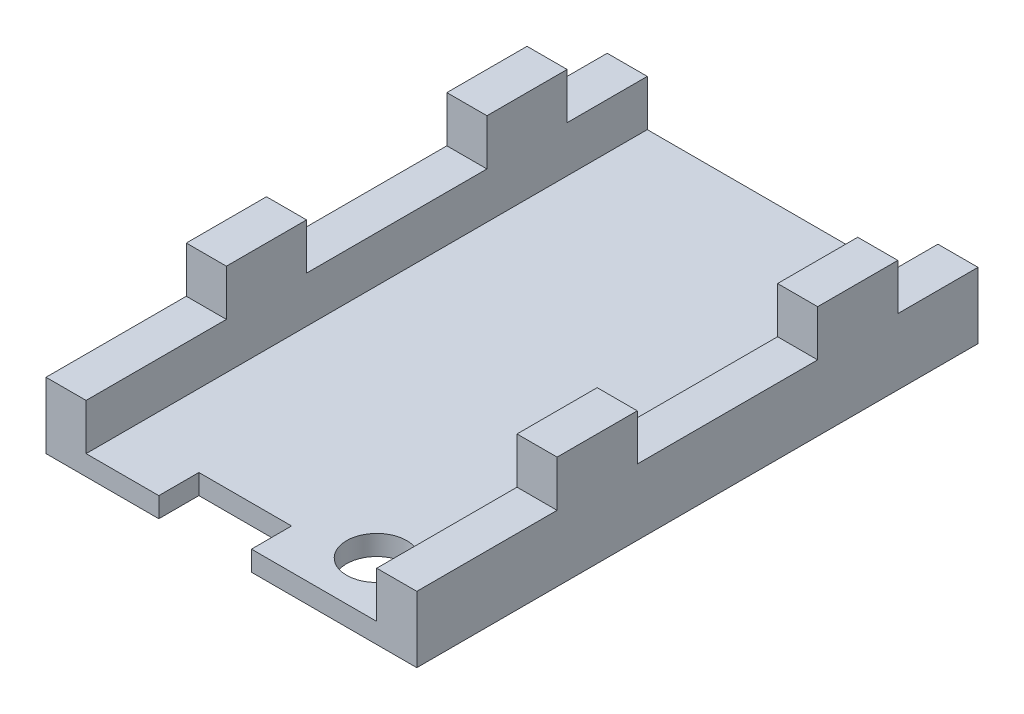
ISO-10303-21;
HEADER;
FILE_DESCRIPTION(('STEP AP214'),'2;1');
FILE_NAME('part.step','',(''),(''),'','','');
FILE_SCHEMA(('AUTOMOTIVE_DESIGN { 1 0 10303 214 1 1 1 1 }'));
ENDSEC;
DATA;
#1=APPLICATION_CONTEXT('core data for automotive mechanical design processes');
#2=APPLICATION_PROTOCOL_DEFINITION('international standard','automotive_design',2000,#1);
#3=PRODUCT_CONTEXT('',#1,'mechanical');
#4=PRODUCT('Part','Part','',(#3));
#5=PRODUCT_RELATED_PRODUCT_CATEGORY('part','',(#4));
#6=PRODUCT_DEFINITION_FORMATION('','',#4);
#7=PRODUCT_DEFINITION_CONTEXT('part definition',#1,'design');
#8=PRODUCT_DEFINITION('design','',#6,#7);
#9=PRODUCT_DEFINITION_SHAPE('','',#8);
#10=(LENGTH_UNIT() NAMED_UNIT(*) SI_UNIT(.MILLI.,.METRE.));
#11=(NAMED_UNIT(*) PLANE_ANGLE_UNIT() SI_UNIT($,.RADIAN.));
#12=(NAMED_UNIT(*) SI_UNIT($,.STERADIAN.) SOLID_ANGLE_UNIT());
#13=UNCERTAINTY_MEASURE_WITH_UNIT(LENGTH_MEASURE(1.E-05),#10,'distance_accuracy_value','');
#14=(GEOMETRIC_REPRESENTATION_CONTEXT(3) GLOBAL_UNCERTAINTY_ASSIGNED_CONTEXT((#13)) GLOBAL_UNIT_ASSIGNED_CONTEXT((#10,
#11,#12)) REPRESENTATION_CONTEXT('',''));
#15=CARTESIAN_POINT('',(0.,0.,0.));
#16=DIRECTION('',(0.,0.,1.));
#17=DIRECTION('',(1.,0.,0.));
#18=AXIS2_PLACEMENT_3D('',#15,#16,#17);
#19=CARTESIAN_POINT('',(0.,3.3,0.));
#20=DIRECTION('',(0.,-1.,0.));
#21=DIRECTION('',(0.,0.,-1.));
#22=AXIS2_PLACEMENT_3D('',#19,#20,#21);
#23=PLANE('',#22);
#24=DIRECTION('',(1.,0.,0.));
#25=VECTOR('',#24,1.);
#26=CARTESIAN_POINT('',(-12.7473745827803,3.3,6.34895788650398));
#27=LINE('',#26,#25);
#28=CARTESIAN_POINT('',(-12.7473745827803,3.3,6.34895788650398));
#29=VERTEX_POINT('',#28);
#30=CARTESIAN_POINT('',(-10.7473745827803,3.3,6.34895788650398));
#31=VERTEX_POINT('',#30);
#32=EDGE_CURVE('E516',#29,#31,#27,.T.);
#33=ORIENTED_EDGE('',*,*,#32,.F.);
#34=DIRECTION('',(0.,0.,1.));
#35=VECTOR('',#34,1.);
#36=CARTESIAN_POINT('',(-12.7473745827803,3.3,-14.651042113496));
#37=LINE('',#36,#35);
#38=CARTESIAN_POINT('',(-12.7473745827803,3.3,13.348957886504));
#39=VERTEX_POINT('',#38);
#40=EDGE_CURVE('E245',#29,#39,#37,.T.);
#41=ORIENTED_EDGE('',*,*,#40,.T.);
#42=DIRECTION('',(1.,0.,0.));
#43=VECTOR('',#42,1.);
#44=CARTESIAN_POINT('',(-10.7473745827803,3.3,13.348957886504));
#45=LINE('',#44,#43);
#46=CARTESIAN_POINT('',(-10.7473745827803,3.3,13.348957886504));
#47=VERTEX_POINT('',#46);
#48=EDGE_CURVE('E369',#39,#47,#45,.T.);
#49=ORIENTED_EDGE('',*,*,#48,.T.);
#50=DIRECTION('',(0.,0.,-1.));
#51=VECTOR('',#50,1.);
#52=CARTESIAN_POINT('',(-10.7473745827803,3.3,-14.651042113496));
#53=LINE('',#52,#51);
#54=EDGE_CURVE('E59',#47,#31,#53,.T.);
#55=ORIENTED_EDGE('',*,*,#54,.T.);
#56=EDGE_LOOP('',(#33,#41,#49,#55));
#57=FACE_BOUND('',#56,.T.);
#58=ADVANCED_FACE('F33',(#57),#23,.F.);
#59=DIRECTION('',(-1.,0.,0.));
#60=VECTOR('',#59,1.);
#61=CARTESIAN_POINT('',(-12.7473745827803,3.3,2.34895788650399));
#62=LINE('',#61,#60);
#63=CARTESIAN_POINT('',(-10.7473745827803,3.3,2.34895788650399));
#64=VERTEX_POINT('',#63);
#65=CARTESIAN_POINT('',(-12.7473745827803,3.3,2.34895788650399));
#66=VERTEX_POINT('',#65);
#67=EDGE_CURVE('E51',#64,#66,#62,.T.);
#68=ORIENTED_EDGE('',*,*,#67,.F.);
#69=CARTESIAN_POINT('',(-10.7473745827803,3.3,-6.65104211349602));
#70=VERTEX_POINT('',#69);
#71=EDGE_CURVE('E364',#64,#70,#53,.T.);
#72=ORIENTED_EDGE('',*,*,#71,.T.);
#73=DIRECTION('',(1.,0.,0.));
#74=VECTOR('',#73,1.);
#75=CARTESIAN_POINT('',(-12.7473745827803,3.3,-6.65104211349602));
#76=LINE('',#75,#74);
#77=CARTESIAN_POINT('',(-12.7473745827803,3.3,-6.65104211349602));
#78=VERTEX_POINT('',#77);
#79=EDGE_CURVE('E246',#78,#70,#76,.T.);
#80=ORIENTED_EDGE('',*,*,#79,.F.);
#81=EDGE_CURVE('E370',#78,#66,#37,.T.);
#82=ORIENTED_EDGE('',*,*,#81,.T.);
#83=EDGE_LOOP('',(#68,#72,#80,#82));
#84=FACE_BOUND('',#83,.T.);
#85=ADVANCED_FACE('F537',(#84),#23,.F.);
#86=DIRECTION('',(-1.,0.,0.));
#87=VECTOR('',#86,1.);
#88=CARTESIAN_POINT('',(-12.7473745827803,3.3,-10.651042113496));
#89=LINE('',#88,#87);
#90=CARTESIAN_POINT('',(-10.7473745827803,3.3,-10.651042113496));
#91=VERTEX_POINT('',#90);
#92=CARTESIAN_POINT('',(-12.7473745827803,3.3,-10.651042113496));
#93=VERTEX_POINT('',#92);
#94=EDGE_CURVE('E249',#91,#93,#89,.T.);
#95=ORIENTED_EDGE('',*,*,#94,.F.);
#96=CARTESIAN_POINT('',(-10.7473745827803,3.3,-14.651042113496));
#97=VERTEX_POINT('',#96);
#98=EDGE_CURVE('E365',#91,#97,#53,.T.);
#99=ORIENTED_EDGE('',*,*,#98,.T.);
#100=DIRECTION('',(-1.,0.,0.));
#101=VECTOR('',#100,1.);
#102=CARTESIAN_POINT('',(-10.7473745827803,3.3,-14.651042113496));
#103=LINE('',#102,#101);
#104=CARTESIAN_POINT('',(-12.7473745827803,3.3,-14.651042113496));
#105=VERTEX_POINT('',#104);
#106=EDGE_CURVE('E363',#97,#105,#103,.T.);
#107=ORIENTED_EDGE('',*,*,#106,.T.);
#108=EDGE_CURVE('E367',#105,#93,#37,.T.);
#109=ORIENTED_EDGE('',*,*,#108,.T.);
#110=EDGE_LOOP('',(#95,#99,#107,#109));
#111=FACE_BOUND('',#110,.T.);
#112=ADVANCED_FACE('F536',(#111),#23,.F.);
#113=CARTESIAN_POINT('',(0.,3.3,0.));
#114=DIRECTION('',(0.,1.,0.));
#115=DIRECTION('',(0.,0.,1.));
#116=AXIS2_PLACEMENT_3D('',#113,#114,#115);
#117=PLANE('',#116);
#118=DIRECTION('',(0.,0.,-1.));
#119=VECTOR('',#118,1.);
#120=CARTESIAN_POINT('',(-27.2473745827803,3.3,-14.651042113496));
#121=LINE('',#120,#119);
#122=CARTESIAN_POINT('',(-27.2473745827803,3.3,13.348957886504));
#123=VERTEX_POINT('',#122);
#124=CARTESIAN_POINT('',(-27.2473745827803,3.3,6.34895788650398));
#125=VERTEX_POINT('',#124);
#126=EDGE_CURVE('E387',#123,#125,#121,.T.);
#127=ORIENTED_EDGE('',*,*,#126,.T.);
#128=DIRECTION('',(1.,0.,0.));
#129=VECTOR('',#128,1.);
#130=CARTESIAN_POINT('',(-29.2473745827803,3.3,6.34895788650398));
#131=LINE('',#130,#129);
#132=CARTESIAN_POINT('',(-29.2473745827803,3.3,6.34895788650398));
#133=VERTEX_POINT('',#132);
#134=EDGE_CURVE('E278',#133,#125,#131,.T.);
#135=ORIENTED_EDGE('',*,*,#134,.F.);
#136=DIRECTION('',(0.,0.,1.));
#137=VECTOR('',#136,1.);
#138=CARTESIAN_POINT('',(-29.2473745827803,3.3,-14.651042113496));
#139=LINE('',#138,#137);
#140=CARTESIAN_POINT('',(-29.2473745827803,3.3,13.348957886504));
#141=VERTEX_POINT('',#140);
#142=EDGE_CURVE('E384',#133,#141,#139,.T.);
#143=ORIENTED_EDGE('',*,*,#142,.T.);
#144=DIRECTION('',(1.,0.,0.));
#145=VECTOR('',#144,1.);
#146=CARTESIAN_POINT('',(-29.2473745827803,3.3,13.348957886504));
#147=LINE('',#146,#145);
#148=EDGE_CURVE('E382',#141,#123,#147,.T.);
#149=ORIENTED_EDGE('',*,*,#148,.T.);
#150=EDGE_LOOP('',(#127,#135,#143,#149));
#151=FACE_BOUND('',#150,.T.);
#152=ADVANCED_FACE('F502',(#151),#117,.T.);
#153=CARTESIAN_POINT('',(-29.2473745827803,3.3,-6.65104211349602));
#154=VERTEX_POINT('',#153);
#155=CARTESIAN_POINT('',(-29.2473745827803,3.3,2.34895788650399));
#156=VERTEX_POINT('',#155);
#157=EDGE_CURVE('E383',#154,#156,#139,.T.);
#158=ORIENTED_EDGE('',*,*,#157,.T.);
#159=DIRECTION('',(-1.,0.,0.));
#160=VECTOR('',#159,1.);
#161=CARTESIAN_POINT('',(-29.2473745827803,3.3,2.34895788650398));
#162=LINE('',#161,#160);
#163=CARTESIAN_POINT('',(-27.2473745827803,3.3,2.34895788650398));
#164=VERTEX_POINT('',#163);
#165=EDGE_CURVE('E283',#164,#156,#162,.T.);
#166=ORIENTED_EDGE('',*,*,#165,.F.);
#167=CARTESIAN_POINT('',(-27.2473745827803,3.3,-6.65104211349602));
#168=VERTEX_POINT('',#167);
#169=EDGE_CURVE('E390',#164,#168,#121,.T.);
#170=ORIENTED_EDGE('',*,*,#169,.T.);
#171=DIRECTION('',(1.,0.,0.));
#172=VECTOR('',#171,1.);
#173=CARTESIAN_POINT('',(-29.2473745827803,3.3,-6.65104211349602));
#174=LINE('',#173,#172);
#175=EDGE_CURVE('E305',#154,#168,#174,.T.);
#176=ORIENTED_EDGE('',*,*,#175,.F.);
#177=EDGE_LOOP('',(#158,#166,#170,#176));
#178=FACE_BOUND('',#177,.T.);
#179=ADVANCED_FACE('F489',(#178),#117,.T.);
#180=CARTESIAN_POINT('',(-29.2473745827803,3.3,-14.651042113496));
#181=VERTEX_POINT('',#180);
#182=CARTESIAN_POINT('',(-29.2473745827803,3.3,-10.651042113496));
#183=VERTEX_POINT('',#182);
#184=EDGE_CURVE('E379',#181,#183,#139,.T.);
#185=ORIENTED_EDGE('',*,*,#184,.T.);
#186=DIRECTION('',(-1.,0.,0.));
#187=VECTOR('',#186,1.);
#188=CARTESIAN_POINT('',(-29.2473745827803,3.3,-10.651042113496));
#189=LINE('',#188,#187);
#190=CARTESIAN_POINT('',(-27.2473745827803,3.3,-10.651042113496));
#191=VERTEX_POINT('',#190);
#192=EDGE_CURVE('E310',#191,#183,#189,.T.);
#193=ORIENTED_EDGE('',*,*,#192,.F.);
#194=CARTESIAN_POINT('',(-27.2473745827803,3.3,-14.651042113496));
#195=VERTEX_POINT('',#194);
#196=EDGE_CURVE('E386',#191,#195,#121,.T.);
#197=ORIENTED_EDGE('',*,*,#196,.T.);
#198=DIRECTION('',(-1.,0.,0.));
#199=VECTOR('',#198,1.);
#200=CARTESIAN_POINT('',(-29.2473745827803,3.3,-14.651042113496));
#201=LINE('',#200,#199);
#202=EDGE_CURVE('E389',#195,#181,#201,.T.);
#203=ORIENTED_EDGE('',*,*,#202,.T.);
#204=EDGE_LOOP('',(#185,#193,#197,#203));
#205=FACE_BOUND('',#204,.T.);
#206=ADVANCED_FACE('F474',(#205),#117,.T.);
#207=CARTESIAN_POINT('',(-29.2473745827803,1.,13.348957886504));
#208=DIRECTION('',(0.,0.,-1.));
#209=DIRECTION('',(-1.,0.,0.));
#210=AXIS2_PLACEMENT_3D('',#207,#208,#209);
#211=PLANE('',#210);
#212=DIRECTION('',(1.,0.,0.));
#213=VECTOR('',#212,1.);
#214=CARTESIAN_POINT('',(-29.2473745827803,1.,13.348957886504));
#215=LINE('',#214,#213);
#216=CARTESIAN_POINT('',(-18.9957745827803,1.,13.348957886504));
#217=VERTEX_POINT('',#216);
#218=CARTESIAN_POINT('',(-12.7473745827803,1.,13.348957886504));
#219=VERTEX_POINT('',#218);
#220=EDGE_CURVE('E37',#217,#219,#215,.T.);
#221=ORIENTED_EDGE('',*,*,#220,.F.);
#222=DIRECTION('',(0.,-1.,0.));
#223=VECTOR('',#222,1.);
#224=CARTESIAN_POINT('',(-18.9957745827803,2.3,13.348957886504));
#225=LINE('',#224,#223);
#226=CARTESIAN_POINT('',(-18.9957745827803,0.,13.348957886504));
#227=VERTEX_POINT('',#226);
#228=EDGE_CURVE('E337',#217,#227,#225,.T.);
#229=ORIENTED_EDGE('',*,*,#228,.T.);
#230=DIRECTION('',(1.,0.,0.));
#231=VECTOR('',#230,1.);
#232=CARTESIAN_POINT('',(-29.2473745827803,0.,13.348957886504));
#233=LINE('',#232,#231);
#234=CARTESIAN_POINT('',(-10.7473745827803,0.,13.348957886504));
#235=VERTEX_POINT('',#234);
#236=EDGE_CURVE('E421',#227,#235,#233,.T.);
#237=ORIENTED_EDGE('',*,*,#236,.T.);
#238=DIRECTION('',(0.,-1.,0.));
#239=VECTOR('',#238,1.);
#240=CARTESIAN_POINT('',(-10.7473745827803,1.,13.348957886504));
#241=LINE('',#240,#239);
#242=EDGE_CURVE('E433',#47,#235,#241,.T.);
#243=ORIENTED_EDGE('',*,*,#242,.F.);
#244=ORIENTED_EDGE('',*,*,#48,.F.);
#245=DIRECTION('',(0.,-1.,0.));
#246=VECTOR('',#245,1.);
#247=CARTESIAN_POINT('',(-12.7473745827803,3.3,13.348957886504));
#248=LINE('',#247,#246);
#249=EDGE_CURVE('E372',#39,#219,#248,.T.);
#250=ORIENTED_EDGE('',*,*,#249,.T.);
#251=EDGE_LOOP('',(#221,#229,#237,#243,#244,#250));
#252=FACE_BOUND('',#251,.T.);
#253=ADVANCED_FACE('F465',(#252),#211,.F.);
#254=CARTESIAN_POINT('',(0.,1.,0.));
#255=DIRECTION('',(0.,-1.,0.));
#256=DIRECTION('',(0.,0.,-1.));
#257=AXIS2_PLACEMENT_3D('',#254,#255,#256);
#258=PLANE('',#257);
#259=CARTESIAN_POINT('',(-15.4905745827803,1.,10.605757886504));
#260=DIRECTION('',(0.,-1.,0.));
#261=DIRECTION('',(0.,0.,-1.));
#262=AXIS2_PLACEMENT_3D('',#259,#260,#261);
#263=CIRCLE('',#262,1.5);
#264=CARTESIAN_POINT('',(-15.4905745827803,1.,9.10575788650398));
#265=VERTEX_POINT('',#264);
#266=EDGE_CURVE('E358',#265,#265,#263,.T.);
#267=ORIENTED_EDGE('',*,*,#266,.T.);
#268=EDGE_LOOP('',(#267));
#269=FACE_BOUND('',#268,.T.);
#270=DIRECTION('',(1.,0.,0.));
#271=VECTOR('',#270,1.);
#272=CARTESIAN_POINT('',(0.,1.,11.348957886504));
#273=LINE('',#272,#271);
#274=CARTESIAN_POINT('',(-23.6185745827803,1.,11.348957886504));
#275=VERTEX_POINT('',#274);
#276=CARTESIAN_POINT('',(-18.9957745827803,1.,11.348957886504));
#277=VERTEX_POINT('',#276);
#278=EDGE_CURVE('E349',#275,#277,#273,.T.);
#279=ORIENTED_EDGE('',*,*,#278,.T.);
#280=DIRECTION('',(0.,0.,1.));
#281=VECTOR('',#280,1.);
#282=CARTESIAN_POINT('',(-18.9957745827803,1.,0.));
#283=LINE('',#282,#281);
#284=EDGE_CURVE('E352',#277,#217,#283,.T.);
#285=ORIENTED_EDGE('',*,*,#284,.T.);
#286=ORIENTED_EDGE('',*,*,#220,.T.);
#287=DIRECTION('',(0.,0.,1.));
#288=VECTOR('',#287,1.);
#289=CARTESIAN_POINT('',(-12.7473745827803,1.,-14.651042113496));
#290=LINE('',#289,#288);
#291=CARTESIAN_POINT('',(-12.7473745827803,1.,-14.651042113496));
#292=VERTEX_POINT('',#291);
#293=EDGE_CURVE('E361',#292,#219,#290,.T.);
#294=ORIENTED_EDGE('',*,*,#293,.F.);
#295=DIRECTION('',(1.,0.,0.));
#296=VECTOR('',#295,1.);
#297=CARTESIAN_POINT('',(-29.2473745827803,1.,-14.651042113496));
#298=LINE('',#297,#296);
#299=CARTESIAN_POINT('',(-27.2473745827803,1.,-14.651042113496));
#300=VERTEX_POINT('',#299);
#301=EDGE_CURVE('E429',#300,#292,#298,.T.);
#302=ORIENTED_EDGE('',*,*,#301,.F.);
#303=DIRECTION('',(0.,0.,-1.));
#304=VECTOR('',#303,1.);
#305=CARTESIAN_POINT('',(-27.2473745827803,1.,-14.651042113496));
#306=LINE('',#305,#304);
#307=CARTESIAN_POINT('',(-27.2473745827803,1.,13.348957886504));
#308=VERTEX_POINT('',#307);
#309=EDGE_CURVE('E378',#308,#300,#306,.T.);
#310=ORIENTED_EDGE('',*,*,#309,.F.);
#311=CARTESIAN_POINT('',(-23.6185745827803,1.,13.348957886504));
#312=VERTEX_POINT('',#311);
#313=EDGE_CURVE('E401',#308,#312,#215,.T.);
#314=ORIENTED_EDGE('',*,*,#313,.T.);
#315=DIRECTION('',(0.,0.,-1.));
#316=VECTOR('',#315,1.);
#317=CARTESIAN_POINT('',(-23.6185745827803,1.,0.));
#318=LINE('',#317,#316);
#319=EDGE_CURVE('E340',#312,#275,#318,.T.);
#320=ORIENTED_EDGE('',*,*,#319,.T.);
#321=EDGE_LOOP('',(#279,#285,#286,#294,#302,#310,#314,#320));
#322=FACE_BOUND('',#321,.T.);
#323=ADVANCED_FACE('F445',(#269,#322),#258,.F.);
#324=CARTESIAN_POINT('',(-29.2473745827803,1.,-14.651042113496));
#325=DIRECTION('',(0.,0.,-1.));
#326=DIRECTION('',(-1.,0.,0.));
#327=AXIS2_PLACEMENT_3D('',#324,#325,#326);
#328=PLANE('',#327);
#329=DIRECTION('',(1.,0.,0.));
#330=VECTOR('',#329,1.);
#331=CARTESIAN_POINT('',(-29.2473745827803,0.,-14.651042113496));
#332=LINE('',#331,#330);
#333=CARTESIAN_POINT('',(-29.2473745827803,0.,-14.651042113496));
#334=VERTEX_POINT('',#333);
#335=CARTESIAN_POINT('',(-10.7473745827803,0.,-14.651042113496));
#336=VERTEX_POINT('',#335);
#337=EDGE_CURVE('E409',#334,#336,#332,.T.);
#338=ORIENTED_EDGE('',*,*,#337,.F.);
#339=DIRECTION('',(0.,-1.,0.));
#340=VECTOR('',#339,1.);
#341=CARTESIAN_POINT('',(-29.2473745827803,1.,-14.651042113496));
#342=LINE('',#341,#340);
#343=EDGE_CURVE('E11',#181,#334,#342,.T.);
#344=ORIENTED_EDGE('',*,*,#343,.F.);
#345=ORIENTED_EDGE('',*,*,#202,.F.);
#346=DIRECTION('',(0.,-1.,0.));
#347=VECTOR('',#346,1.);
#348=CARTESIAN_POINT('',(-27.2473745827803,3.3,-14.651042113496));
#349=LINE('',#348,#347);
#350=EDGE_CURVE('E393',#195,#300,#349,.T.);
#351=ORIENTED_EDGE('',*,*,#350,.T.);
#352=ORIENTED_EDGE('',*,*,#301,.T.);
#353=DIRECTION('',(0.,-1.,0.));
#354=VECTOR('',#353,1.);
#355=CARTESIAN_POINT('',(-12.7473745827803,3.3,-14.651042113496));
#356=LINE('',#355,#354);
#357=EDGE_CURVE('E376',#105,#292,#356,.T.);
#358=ORIENTED_EDGE('',*,*,#357,.F.);
#359=ORIENTED_EDGE('',*,*,#106,.F.);
#360=DIRECTION('',(0.,-1.,0.));
#361=VECTOR('',#360,1.);
#362=CARTESIAN_POINT('',(-10.7473745827803,1.,-14.651042113496));
#363=LINE('',#362,#361);
#364=EDGE_CURVE('E436',#97,#336,#363,.T.);
#365=ORIENTED_EDGE('',*,*,#364,.T.);
#366=EDGE_LOOP('',(#338,#344,#345,#351,#352,#358,#359,#365));
#367=FACE_BOUND('',#366,.T.);
#368=ADVANCED_FACE('F35',(#367),#328,.T.);
#369=CARTESIAN_POINT('',(-29.2473745827803,1.,-14.651042113496));
#370=DIRECTION('',(1.,0.,0.));
#371=DIRECTION('',(0.,0.,-1.));
#372=AXIS2_PLACEMENT_3D('',#369,#370,#371);
#373=PLANE('',#372);
#374=DIRECTION('',(0.,0.,1.));
#375=VECTOR('',#374,1.);
#376=CARTESIAN_POINT('',(-29.2473745827803,0.,-14.651042113496));
#377=LINE('',#376,#375);
#378=CARTESIAN_POINT('',(-29.2473745827803,0.,13.348957886504));
#379=VERTEX_POINT('',#378);
#380=EDGE_CURVE('E428',#334,#379,#377,.T.);
#381=ORIENTED_EDGE('',*,*,#380,.T.);
#382=DIRECTION('',(0.,-1.,0.));
#383=VECTOR('',#382,1.);
#384=CARTESIAN_POINT('',(-29.2473745827803,1.,13.348957886504));
#385=LINE('',#384,#383);
#386=EDGE_CURVE('E43',#141,#379,#385,.T.);
#387=ORIENTED_EDGE('',*,*,#386,.F.);
#388=ORIENTED_EDGE('',*,*,#142,.F.);
#389=DIRECTION('',(0.,-1.,0.));
#390=VECTOR('',#389,1.);
#391=CARTESIAN_POINT('',(-29.2473745827803,5.6,6.34895788650398));
#392=LINE('',#391,#390);
#393=CARTESIAN_POINT('',(-29.2473745827803,5.6,6.34895788650398));
#394=VERTEX_POINT('',#393);
#395=EDGE_CURVE('E302',#394,#133,#392,.T.);
#396=ORIENTED_EDGE('',*,*,#395,.F.);
#397=DIRECTION('',(0.,0.,1.));
#398=VECTOR('',#397,1.);
#399=CARTESIAN_POINT('',(-29.2473745827803,5.6,2.34895788650398));
#400=LINE('',#399,#398);
#401=CARTESIAN_POINT('',(-29.2473745827803,5.6,2.34895788650398));
#402=VERTEX_POINT('',#401);
#403=EDGE_CURVE('E279',#402,#394,#400,.T.);
#404=ORIENTED_EDGE('',*,*,#403,.F.);
#405=DIRECTION('',(0.,-1.,0.));
#406=VECTOR('',#405,1.);
#407=CARTESIAN_POINT('',(-29.2473745827803,5.6,2.34895788650398));
#408=LINE('',#407,#406);
#409=EDGE_CURVE('E289',#402,#156,#408,.T.);
#410=ORIENTED_EDGE('',*,*,#409,.T.);
#411=ORIENTED_EDGE('',*,*,#157,.F.);
#412=DIRECTION('',(0.,-1.,0.));
#413=VECTOR('',#412,1.);
#414=CARTESIAN_POINT('',(-29.2473745827803,5.6,-6.65104211349602));
#415=LINE('',#414,#413);
#416=CARTESIAN_POINT('',(-29.2473745827803,5.6,-6.65104211349602));
#417=VERTEX_POINT('',#416);
#418=EDGE_CURVE('E327',#417,#154,#415,.T.);
#419=ORIENTED_EDGE('',*,*,#418,.F.);
#420=DIRECTION('',(0.,0.,1.));
#421=VECTOR('',#420,1.);
#422=CARTESIAN_POINT('',(-29.2473745827803,5.6,-10.651042113496));
#423=LINE('',#422,#421);
#424=CARTESIAN_POINT('',(-29.2473745827803,5.6,-10.651042113496));
#425=VERTEX_POINT('',#424);
#426=EDGE_CURVE('E306',#425,#417,#423,.T.);
#427=ORIENTED_EDGE('',*,*,#426,.F.);
#428=DIRECTION('',(0.,-1.,0.));
#429=VECTOR('',#428,1.);
#430=CARTESIAN_POINT('',(-29.2473745827803,5.6,-10.651042113496));
#431=LINE('',#430,#429);
#432=EDGE_CURVE('E316',#425,#183,#431,.T.);
#433=ORIENTED_EDGE('',*,*,#432,.T.);
#434=ORIENTED_EDGE('',*,*,#184,.F.);
#435=ORIENTED_EDGE('',*,*,#343,.T.);
#436=EDGE_LOOP('',(#381,#387,#388,#396,#404,#410,#411,#419,#427,#433,#434,#435));
#437=FACE_BOUND('',#436,.T.);
#438=ADVANCED_FACE('F477',(#437),#373,.F.);
#439=CARTESIAN_POINT('',(-23.6185745827803,0.,13.348957886504));
#440=VERTEX_POINT('',#439);
#441=EDGE_CURVE('E425',#379,#440,#233,.T.);
#442=ORIENTED_EDGE('',*,*,#441,.T.);
#443=DIRECTION('',(0.,-1.,0.));
#444=VECTOR('',#443,1.);
#445=CARTESIAN_POINT('',(-23.6185745827803,2.3,13.348957886504));
#446=LINE('',#445,#444);
#447=EDGE_CURVE('E343',#312,#440,#446,.T.);
#448=ORIENTED_EDGE('',*,*,#447,.F.);
#449=ORIENTED_EDGE('',*,*,#313,.F.);
#450=DIRECTION('',(0.,-1.,0.));
#451=VECTOR('',#450,1.);
#452=CARTESIAN_POINT('',(-27.2473745827803,3.3,13.348957886504));
#453=LINE('',#452,#451);
#454=EDGE_CURVE('E405',#123,#308,#453,.T.);
#455=ORIENTED_EDGE('',*,*,#454,.F.);
#456=ORIENTED_EDGE('',*,*,#148,.F.);
#457=ORIENTED_EDGE('',*,*,#386,.T.);
#458=EDGE_LOOP('',(#442,#448,#449,#455,#456,#457));
#459=FACE_BOUND('',#458,.T.);
#460=ADVANCED_FACE('F448',(#459),#211,.F.);
#461=CARTESIAN_POINT('',(-10.7473745827803,1.,-14.651042113496));
#462=DIRECTION('',(1.,0.,0.));
#463=DIRECTION('',(0.,0.,-1.));
#464=AXIS2_PLACEMENT_3D('',#461,#462,#463);
#465=PLANE('',#464);
#466=DIRECTION('',(0.,0.,1.));
#467=VECTOR('',#466,1.);
#468=CARTESIAN_POINT('',(-10.7473745827803,0.,-14.651042113496));
#469=LINE('',#468,#467);
#470=EDGE_CURVE('E415',#336,#235,#469,.T.);
#471=ORIENTED_EDGE('',*,*,#470,.F.);
#472=ORIENTED_EDGE('',*,*,#364,.F.);
#473=ORIENTED_EDGE('',*,*,#98,.F.);
#474=DIRECTION('',(0.,-1.,0.));
#475=VECTOR('',#474,1.);
#476=CARTESIAN_POINT('',(-10.7473745827803,5.6,-10.651042113496));
#477=LINE('',#476,#475);
#478=CARTESIAN_POINT('',(-10.7473745827803,5.6,-10.651042113496));
#479=VERTEX_POINT('',#478);
#480=EDGE_CURVE('E269',#479,#91,#477,.T.);
#481=ORIENTED_EDGE('',*,*,#480,.F.);
#482=DIRECTION('',(0.,0.,-1.));
#483=VECTOR('',#482,1.);
#484=CARTESIAN_POINT('',(-10.7473745827803,5.6,-10.651042113496));
#485=LINE('',#484,#483);
#486=CARTESIAN_POINT('',(-10.7473745827803,5.6,-6.65104211349602));
#487=VERTEX_POINT('',#486);
#488=EDGE_CURVE('E260',#487,#479,#485,.T.);
#489=ORIENTED_EDGE('',*,*,#488,.F.);
#490=DIRECTION('',(0.,-1.,0.));
#491=VECTOR('',#490,1.);
#492=CARTESIAN_POINT('',(-10.7473745827803,5.6,-6.65104211349602));
#493=LINE('',#492,#491);
#494=EDGE_CURVE('E272',#487,#70,#493,.T.);
#495=ORIENTED_EDGE('',*,*,#494,.T.);
#496=ORIENTED_EDGE('',*,*,#71,.F.);
#497=DIRECTION('',(0.,-1.,0.));
#498=VECTOR('',#497,1.);
#499=CARTESIAN_POINT('',(-10.7473745827803,5.6,2.34895788650398));
#500=LINE('',#499,#498);
#501=CARTESIAN_POINT('',(-10.7473745827803,5.6,2.34895788650398));
#502=VERTEX_POINT('',#501);
#503=EDGE_CURVE('E251',#502,#64,#500,.T.);
#504=ORIENTED_EDGE('',*,*,#503,.F.);
#505=DIRECTION('',(0.,0.,-1.));
#506=VECTOR('',#505,1.);
#507=CARTESIAN_POINT('',(-10.7473745827803,5.6,2.34895788650398));
#508=LINE('',#507,#506);
#509=CARTESIAN_POINT('',(-10.7473745827803,5.6,6.34895788650398));
#510=VERTEX_POINT('',#509);
#511=EDGE_CURVE('E231',#510,#502,#508,.T.);
#512=ORIENTED_EDGE('',*,*,#511,.F.);
#513=DIRECTION('',(0.,-1.,0.));
#514=VECTOR('',#513,1.);
#515=CARTESIAN_POINT('',(-10.7473745827803,5.6,6.34895788650398));
#516=LINE('',#515,#514);
#517=EDGE_CURVE('E228',#510,#31,#516,.T.);
#518=ORIENTED_EDGE('',*,*,#517,.T.);
#519=ORIENTED_EDGE('',*,*,#54,.F.);
#520=ORIENTED_EDGE('',*,*,#242,.T.);
#521=EDGE_LOOP('',(#471,#472,#473,#481,#489,#495,#496,#504,#512,#518,#519,#520));
#522=FACE_BOUND('',#521,.T.);
#523=ADVANCED_FACE('F509',(#522),#465,.T.);
#524=CARTESIAN_POINT('',(0.,0.,0.));
#525=DIRECTION('',(0.,-1.,0.));
#526=DIRECTION('',(0.,0.,-1.));
#527=AXIS2_PLACEMENT_3D('',#524,#525,#526);
#528=PLANE('',#527);
#529=DIRECTION('',(0.,0.,1.));
#530=VECTOR('',#529,1.);
#531=CARTESIAN_POINT('',(-18.9957745827803,0.,13.348957886504));
#532=LINE('',#531,#530);
#533=CARTESIAN_POINT('',(-18.9957745827803,0.,11.348957886504));
#534=VERTEX_POINT('',#533);
#535=EDGE_CURVE('E329',#534,#227,#532,.T.);
#536=ORIENTED_EDGE('',*,*,#535,.F.);
#537=DIRECTION('',(1.,0.,0.));
#538=VECTOR('',#537,1.);
#539=CARTESIAN_POINT('',(-18.9957745827803,0.,11.348957886504));
#540=LINE('',#539,#538);
#541=CARTESIAN_POINT('',(-23.6185745827803,0.,11.348957886504));
#542=VERTEX_POINT('',#541);
#543=EDGE_CURVE('E334',#542,#534,#540,.T.);
#544=ORIENTED_EDGE('',*,*,#543,.F.);
#545=DIRECTION('',(0.,0.,-1.));
#546=VECTOR('',#545,1.);
#547=CARTESIAN_POINT('',(-23.6185745827803,0.,13.348957886504));
#548=LINE('',#547,#546);
#549=EDGE_CURVE('E331',#440,#542,#548,.T.);
#550=ORIENTED_EDGE('',*,*,#549,.F.);
#551=ORIENTED_EDGE('',*,*,#441,.F.);
#552=ORIENTED_EDGE('',*,*,#380,.F.);
#553=ORIENTED_EDGE('',*,*,#337,.T.);
#554=ORIENTED_EDGE('',*,*,#470,.T.);
#555=ORIENTED_EDGE('',*,*,#236,.F.);
#556=EDGE_LOOP('',(#536,#544,#550,#551,#552,#553,#554,#555));
#557=FACE_BOUND('',#556,.T.);
#558=CARTESIAN_POINT('',(-15.4905745827803,0.,10.605757886504));
#559=DIRECTION('',(0.,-1.,0.));
#560=DIRECTION('',(0.,0.,-1.));
#561=AXIS2_PLACEMENT_3D('',#558,#559,#560);
#562=CIRCLE('',#561,1.5);
#563=CARTESIAN_POINT('',(-15.4905745827803,0.,9.10575788650398));
#564=VERTEX_POINT('',#563);
#565=EDGE_CURVE('E355',#564,#564,#562,.T.);
#566=ORIENTED_EDGE('',*,*,#565,.F.);
#567=EDGE_LOOP('',(#566));
#568=FACE_BOUND('',#567,.T.);
#569=ADVANCED_FACE('F457',(#557,#568),#528,.T.);
#570=CARTESIAN_POINT('',(-27.2473745827803,3.3,-14.651042113496));
#571=DIRECTION('',(-1.,0.,0.));
#572=DIRECTION('',(0.,0.,1.));
#573=AXIS2_PLACEMENT_3D('',#570,#571,#572);
#574=PLANE('',#573);
#575=ORIENTED_EDGE('',*,*,#309,.T.);
#576=ORIENTED_EDGE('',*,*,#350,.F.);
#577=ORIENTED_EDGE('',*,*,#196,.F.);
#578=DIRECTION('',(0.,-1.,0.));
#579=VECTOR('',#578,1.);
#580=CARTESIAN_POINT('',(-27.2473745827803,5.6,-10.651042113496));
#581=LINE('',#580,#579);
#582=CARTESIAN_POINT('',(-27.2473745827803,5.6,-10.651042113496));
#583=VERTEX_POINT('',#582);
#584=EDGE_CURVE('E322',#583,#191,#581,.T.);
#585=ORIENTED_EDGE('',*,*,#584,.F.);
#586=DIRECTION('',(0.,0.,-1.));
#587=VECTOR('',#586,1.);
#588=CARTESIAN_POINT('',(-27.2473745827803,5.6,-10.651042113496));
#589=LINE('',#588,#587);
#590=CARTESIAN_POINT('',(-27.2473745827803,5.6,-6.65104211349602));
#591=VERTEX_POINT('',#590);
#592=EDGE_CURVE('E312',#591,#583,#589,.T.);
#593=ORIENTED_EDGE('',*,*,#592,.F.);
#594=DIRECTION('',(0.,-1.,0.));
#595=VECTOR('',#594,1.);
#596=CARTESIAN_POINT('',(-27.2473745827803,5.6,-6.65104211349602));
#597=LINE('',#596,#595);
#598=EDGE_CURVE('E324',#591,#168,#597,.T.);
#599=ORIENTED_EDGE('',*,*,#598,.T.);
#600=ORIENTED_EDGE('',*,*,#169,.F.);
#601=DIRECTION('',(0.,-1.,0.));
#602=VECTOR('',#601,1.);
#603=CARTESIAN_POINT('',(-27.2473745827803,5.6,2.34895788650398));
#604=LINE('',#603,#602);
#605=CARTESIAN_POINT('',(-27.2473745827803,5.6,2.34895788650398));
#606=VERTEX_POINT('',#605);
#607=EDGE_CURVE('E296',#606,#164,#604,.T.);
#608=ORIENTED_EDGE('',*,*,#607,.F.);
#609=DIRECTION('',(0.,0.,-1.));
#610=VECTOR('',#609,1.);
#611=CARTESIAN_POINT('',(-27.2473745827803,5.6,2.34895788650398));
#612=LINE('',#611,#610);
#613=CARTESIAN_POINT('',(-27.2473745827803,5.6,6.34895788650398));
#614=VERTEX_POINT('',#613);
#615=EDGE_CURVE('E285',#614,#606,#612,.T.);
#616=ORIENTED_EDGE('',*,*,#615,.F.);
#617=DIRECTION('',(0.,-1.,0.));
#618=VECTOR('',#617,1.);
#619=CARTESIAN_POINT('',(-27.2473745827803,5.6,6.34895788650398));
#620=LINE('',#619,#618);
#621=EDGE_CURVE('E299',#614,#125,#620,.T.);
#622=ORIENTED_EDGE('',*,*,#621,.T.);
#623=ORIENTED_EDGE('',*,*,#126,.F.);
#624=ORIENTED_EDGE('',*,*,#454,.T.);
#625=EDGE_LOOP('',(#575,#576,#577,#585,#593,#599,#600,#608,#616,#622,#623,#624));
#626=FACE_BOUND('',#625,.T.);
#627=ADVANCED_FACE('F469',(#626),#574,.F.);
#628=CARTESIAN_POINT('',(-12.7473745827803,3.3,-14.651042113496));
#629=DIRECTION('',(1.,0.,0.));
#630=DIRECTION('',(0.,0.,-1.));
#631=AXIS2_PLACEMENT_3D('',#628,#629,#630);
#632=PLANE('',#631);
#633=ORIENTED_EDGE('',*,*,#293,.T.);
#634=ORIENTED_EDGE('',*,*,#249,.F.);
#635=ORIENTED_EDGE('',*,*,#40,.F.);
#636=DIRECTION('',(0.,-1.,0.));
#637=VECTOR('',#636,1.);
#638=CARTESIAN_POINT('',(-12.7473745827803,5.6,6.34895788650398));
#639=LINE('',#638,#637);
#640=CARTESIAN_POINT('',(-12.7473745827803,5.6,6.34895788650398));
#641=VERTEX_POINT('',#640);
#642=EDGE_CURVE('E226',#641,#29,#639,.T.);
#643=ORIENTED_EDGE('',*,*,#642,.F.);
#644=DIRECTION('',(0.,0.,1.));
#645=VECTOR('',#644,1.);
#646=CARTESIAN_POINT('',(-12.7473745827803,5.6,2.34895788650399));
#647=LINE('',#646,#645);
#648=CARTESIAN_POINT('',(-12.7473745827803,5.6,2.34895788650399));
#649=VERTEX_POINT('',#648);
#650=EDGE_CURVE('E232',#649,#641,#647,.T.);
#651=ORIENTED_EDGE('',*,*,#650,.F.);
#652=DIRECTION('',(0.,-1.,0.));
#653=VECTOR('',#652,1.);
#654=CARTESIAN_POINT('',(-12.7473745827803,5.6,2.34895788650399));
#655=LINE('',#654,#653);
#656=EDGE_CURVE('E513',#649,#66,#655,.T.);
#657=ORIENTED_EDGE('',*,*,#656,.T.);
#658=ORIENTED_EDGE('',*,*,#81,.F.);
#659=DIRECTION('',(0.,-1.,0.));
#660=VECTOR('',#659,1.);
#661=CARTESIAN_POINT('',(-12.7473745827803,5.6,-6.65104211349602));
#662=LINE('',#661,#660);
#663=CARTESIAN_POINT('',(-12.7473745827803,5.6,-6.65104211349602));
#664=VERTEX_POINT('',#663);
#665=EDGE_CURVE('E275',#664,#78,#662,.T.);
#666=ORIENTED_EDGE('',*,*,#665,.F.);
#667=DIRECTION('',(0.,0.,1.));
#668=VECTOR('',#667,1.);
#669=CARTESIAN_POINT('',(-12.7473745827803,5.6,-10.651042113496));
#670=LINE('',#669,#668);
#671=CARTESIAN_POINT('',(-12.7473745827803,5.6,-10.651042113496));
#672=VERTEX_POINT('',#671);
#673=EDGE_CURVE('E255',#672,#664,#670,.T.);
#674=ORIENTED_EDGE('',*,*,#673,.F.);
#675=DIRECTION('',(0.,-1.,0.));
#676=VECTOR('',#675,1.);
#677=CARTESIAN_POINT('',(-12.7473745827803,5.6,-10.651042113496));
#678=LINE('',#677,#676);
#679=EDGE_CURVE('E263',#672,#93,#678,.T.);
#680=ORIENTED_EDGE('',*,*,#679,.T.);
#681=ORIENTED_EDGE('',*,*,#108,.F.);
#682=ORIENTED_EDGE('',*,*,#357,.T.);
#683=EDGE_LOOP('',(#633,#634,#635,#643,#651,#657,#658,#666,#674,#680,#681,#682));
#684=FACE_BOUND('',#683,.T.);
#685=ADVANCED_FACE('F243',(#684),#632,.F.);
#686=CARTESIAN_POINT('',(-15.4905745827803,2.3,10.605757886504));
#687=DIRECTION('',(0.,-1.,0.));
#688=DIRECTION('',(0.,0.,-1.));
#689=AXIS2_PLACEMENT_3D('',#686,#687,#688);
#690=CYLINDRICAL_SURFACE('',#689,1.5);
#691=ORIENTED_EDGE('',*,*,#565,.T.);
#692=EDGE_LOOP('',(#691));
#693=FACE_BOUND('',#692,.T.);
#694=ORIENTED_EDGE('',*,*,#266,.F.);
#695=EDGE_LOOP('',(#694));
#696=FACE_BOUND('',#695,.T.);
#697=ADVANCED_FACE('F546',(#693,#696),#690,.F.);
#698=CARTESIAN_POINT('',(-18.9957745827803,2.3,13.348957886504));
#699=DIRECTION('',(1.,0.,0.));
#700=DIRECTION('',(0.,0.,-1.));
#701=AXIS2_PLACEMENT_3D('',#698,#699,#700);
#702=PLANE('',#701);
#703=DIRECTION('',(0.,-1.,0.));
#704=VECTOR('',#703,1.);
#705=CARTESIAN_POINT('',(-18.9957745827803,2.3,11.348957886504));
#706=LINE('',#705,#704);
#707=EDGE_CURVE('E338',#277,#534,#706,.T.);
#708=ORIENTED_EDGE('',*,*,#707,.T.);
#709=ORIENTED_EDGE('',*,*,#535,.T.);
#710=ORIENTED_EDGE('',*,*,#228,.F.);
#711=ORIENTED_EDGE('',*,*,#284,.F.);
#712=EDGE_LOOP('',(#708,#709,#710,#711));
#713=FACE_BOUND('',#712,.T.);
#714=ADVANCED_FACE('F588',(#713),#702,.F.);
#715=CARTESIAN_POINT('',(-18.9957745827803,2.3,11.348957886504));
#716=DIRECTION('',(0.,0.,-1.));
#717=DIRECTION('',(-1.,0.,0.));
#718=AXIS2_PLACEMENT_3D('',#715,#716,#717);
#719=PLANE('',#718);
#720=DIRECTION('',(0.,-1.,0.));
#721=VECTOR('',#720,1.);
#722=CARTESIAN_POINT('',(-23.6185745827803,2.3,11.348957886504));
#723=LINE('',#722,#721);
#724=EDGE_CURVE('E341',#275,#542,#723,.T.);
#725=ORIENTED_EDGE('',*,*,#724,.T.);
#726=ORIENTED_EDGE('',*,*,#543,.T.);
#727=ORIENTED_EDGE('',*,*,#707,.F.);
#728=ORIENTED_EDGE('',*,*,#278,.F.);
#729=EDGE_LOOP('',(#725,#726,#727,#728));
#730=FACE_BOUND('',#729,.T.);
#731=ADVANCED_FACE('F462',(#730),#719,.F.);
#732=CARTESIAN_POINT('',(-23.6185745827803,2.3,13.348957886504));
#733=DIRECTION('',(-1.,0.,0.));
#734=DIRECTION('',(0.,0.,1.));
#735=AXIS2_PLACEMENT_3D('',#732,#733,#734);
#736=PLANE('',#735);
#737=ORIENTED_EDGE('',*,*,#447,.T.);
#738=ORIENTED_EDGE('',*,*,#549,.T.);
#739=ORIENTED_EDGE('',*,*,#724,.F.);
#740=ORIENTED_EDGE('',*,*,#319,.F.);
#741=EDGE_LOOP('',(#737,#738,#739,#740));
#742=FACE_BOUND('',#741,.T.);
#743=ADVANCED_FACE('F453',(#742),#736,.F.);
#744=CARTESIAN_POINT('',(-29.2473745827803,5.6,-6.65104211349602));
#745=DIRECTION('',(0.,0.,-1.));
#746=DIRECTION('',(-1.,0.,0.));
#747=AXIS2_PLACEMENT_3D('',#744,#745,#746);
#748=PLANE('',#747);
#749=ORIENTED_EDGE('',*,*,#175,.T.);
#750=ORIENTED_EDGE('',*,*,#598,.F.);
#751=DIRECTION('',(1.,0.,0.));
#752=VECTOR('',#751,1.);
#753=CARTESIAN_POINT('',(-29.2473745827803,5.6,-6.65104211349602));
#754=LINE('',#753,#752);
#755=EDGE_CURVE('E309',#417,#591,#754,.T.);
#756=ORIENTED_EDGE('',*,*,#755,.F.);
#757=ORIENTED_EDGE('',*,*,#418,.T.);
#758=EDGE_LOOP('',(#749,#750,#756,#757));
#759=FACE_BOUND('',#758,.T.);
#760=ADVANCED_FACE('F494',(#759),#748,.F.);
#761=CARTESIAN_POINT('',(-29.2473745827803,5.6,-10.651042113496));
#762=DIRECTION('',(0.,0.,1.));
#763=DIRECTION('',(1.,0.,0.));
#764=AXIS2_PLACEMENT_3D('',#761,#762,#763);
#765=PLANE('',#764);
#766=ORIENTED_EDGE('',*,*,#192,.T.);
#767=ORIENTED_EDGE('',*,*,#432,.F.);
#768=DIRECTION('',(-1.,0.,0.));
#769=VECTOR('',#768,1.);
#770=CARTESIAN_POINT('',(-29.2473745827803,5.6,-10.651042113496));
#771=LINE('',#770,#769);
#772=EDGE_CURVE('E314',#583,#425,#771,.T.);
#773=ORIENTED_EDGE('',*,*,#772,.F.);
#774=ORIENTED_EDGE('',*,*,#584,.T.);
#775=EDGE_LOOP('',(#766,#767,#773,#774));
#776=FACE_BOUND('',#775,.T.);
#777=ADVANCED_FACE('F483',(#776),#765,.F.);
#778=CARTESIAN_POINT('',(0.,5.6,0.));
#779=DIRECTION('',(0.,1.,0.));
#780=DIRECTION('',(0.,0.,1.));
#781=AXIS2_PLACEMENT_3D('',#778,#779,#780);
#782=PLANE('',#781);
#783=ORIENTED_EDGE('',*,*,#426,.T.);
#784=ORIENTED_EDGE('',*,*,#755,.T.);
#785=ORIENTED_EDGE('',*,*,#592,.T.);
#786=ORIENTED_EDGE('',*,*,#772,.T.);
#787=EDGE_LOOP('',(#783,#784,#785,#786));
#788=FACE_BOUND('',#787,.T.);
#789=ADVANCED_FACE('F496',(#788),#782,.T.);
#790=CARTESIAN_POINT('',(-29.2473745827803,5.6,6.34895788650398));
#791=DIRECTION('',(0.,0.,-1.));
#792=DIRECTION('',(-1.,0.,0.));
#793=AXIS2_PLACEMENT_3D('',#790,#791,#792);
#794=PLANE('',#793);
#795=ORIENTED_EDGE('',*,*,#134,.T.);
#796=ORIENTED_EDGE('',*,*,#621,.F.);
#797=DIRECTION('',(1.,0.,0.));
#798=VECTOR('',#797,1.);
#799=CARTESIAN_POINT('',(-29.2473745827803,5.6,6.34895788650398));
#800=LINE('',#799,#798);
#801=EDGE_CURVE('E282',#394,#614,#800,.T.);
#802=ORIENTED_EDGE('',*,*,#801,.F.);
#803=ORIENTED_EDGE('',*,*,#395,.T.);
#804=EDGE_LOOP('',(#795,#796,#802,#803));
#805=FACE_BOUND('',#804,.T.);
#806=ADVANCED_FACE('F625',(#805),#794,.F.);
#807=CARTESIAN_POINT('',(-29.2473745827803,5.6,2.34895788650398));
#808=DIRECTION('',(0.,0.,1.));
#809=DIRECTION('',(1.,0.,0.));
#810=AXIS2_PLACEMENT_3D('',#807,#808,#809);
#811=PLANE('',#810);
#812=ORIENTED_EDGE('',*,*,#165,.T.);
#813=ORIENTED_EDGE('',*,*,#409,.F.);
#814=DIRECTION('',(-1.,0.,0.));
#815=VECTOR('',#814,1.);
#816=CARTESIAN_POINT('',(-29.2473745827803,5.6,2.34895788650398));
#817=LINE('',#816,#815);
#818=EDGE_CURVE('E287',#606,#402,#817,.T.);
#819=ORIENTED_EDGE('',*,*,#818,.F.);
#820=ORIENTED_EDGE('',*,*,#607,.T.);
#821=EDGE_LOOP('',(#812,#813,#819,#820));
#822=FACE_BOUND('',#821,.T.);
#823=ADVANCED_FACE('F632',(#822),#811,.F.);
#824=CARTESIAN_POINT('',(0.,5.6,0.));
#825=DIRECTION('',(0.,1.,0.));
#826=DIRECTION('',(0.,0.,1.));
#827=AXIS2_PLACEMENT_3D('',#824,#825,#826);
#828=PLANE('',#827);
#829=ORIENTED_EDGE('',*,*,#403,.T.);
#830=ORIENTED_EDGE('',*,*,#801,.T.);
#831=ORIENTED_EDGE('',*,*,#615,.T.);
#832=ORIENTED_EDGE('',*,*,#818,.T.);
#833=EDGE_LOOP('',(#829,#830,#831,#832));
#834=FACE_BOUND('',#833,.T.);
#835=ADVANCED_FACE('F640',(#834),#828,.T.);
#836=CARTESIAN_POINT('',(-12.7473745827803,5.6,-6.65104211349602));
#837=DIRECTION('',(0.,0.,-1.));
#838=DIRECTION('',(-1.,0.,0.));
#839=AXIS2_PLACEMENT_3D('',#836,#837,#838);
#840=PLANE('',#839);
#841=ORIENTED_EDGE('',*,*,#79,.T.);
#842=ORIENTED_EDGE('',*,*,#494,.F.);
#843=DIRECTION('',(1.,0.,0.));
#844=VECTOR('',#843,1.);
#845=CARTESIAN_POINT('',(-12.7473745827803,5.6,-6.65104211349602));
#846=LINE('',#845,#844);
#847=EDGE_CURVE('E258',#664,#487,#846,.T.);
#848=ORIENTED_EDGE('',*,*,#847,.F.);
#849=ORIENTED_EDGE('',*,*,#665,.T.);
#850=EDGE_LOOP('',(#841,#842,#848,#849));
#851=FACE_BOUND('',#850,.T.);
#852=ADVANCED_FACE('F525',(#851),#840,.F.);
#853=CARTESIAN_POINT('',(-12.7473745827803,5.6,-10.651042113496));
#854=DIRECTION('',(0.,0.,1.));
#855=DIRECTION('',(1.,0.,0.));
#856=AXIS2_PLACEMENT_3D('',#853,#854,#855);
#857=PLANE('',#856);
#858=ORIENTED_EDGE('',*,*,#94,.T.);
#859=ORIENTED_EDGE('',*,*,#679,.F.);
#860=DIRECTION('',(-1.,0.,0.));
#861=VECTOR('',#860,1.);
#862=CARTESIAN_POINT('',(-12.7473745827803,5.6,-10.651042113496));
#863=LINE('',#862,#861);
#864=EDGE_CURVE('E262',#479,#672,#863,.T.);
#865=ORIENTED_EDGE('',*,*,#864,.F.);
#866=ORIENTED_EDGE('',*,*,#480,.T.);
#867=EDGE_LOOP('',(#858,#859,#865,#866));
#868=FACE_BOUND('',#867,.T.);
#869=ADVANCED_FACE('F533',(#868),#857,.F.);
#870=CARTESIAN_POINT('',(0.,5.6,0.));
#871=DIRECTION('',(0.,1.,0.));
#872=DIRECTION('',(0.,0.,1.));
#873=AXIS2_PLACEMENT_3D('',#870,#871,#872);
#874=PLANE('',#873);
#875=ORIENTED_EDGE('',*,*,#673,.T.);
#876=ORIENTED_EDGE('',*,*,#847,.T.);
#877=ORIENTED_EDGE('',*,*,#488,.T.);
#878=ORIENTED_EDGE('',*,*,#864,.T.);
#879=EDGE_LOOP('',(#875,#876,#877,#878));
#880=FACE_BOUND('',#879,.T.);
#881=ADVANCED_FACE('F529',(#880),#874,.T.);
#882=CARTESIAN_POINT('',(-12.7473745827803,5.6,6.34895788650398));
#883=DIRECTION('',(0.,0.,-1.));
#884=DIRECTION('',(-1.,0.,0.));
#885=AXIS2_PLACEMENT_3D('',#882,#883,#884);
#886=PLANE('',#885);
#887=ORIENTED_EDGE('',*,*,#32,.T.);
#888=ORIENTED_EDGE('',*,*,#517,.F.);
#889=DIRECTION('',(1.,0.,0.));
#890=VECTOR('',#889,1.);
#891=CARTESIAN_POINT('',(-12.7473745827803,5.6,6.34895788650398));
#892=LINE('',#891,#890);
#893=EDGE_CURVE('E222',#641,#510,#892,.T.);
#894=ORIENTED_EDGE('',*,*,#893,.F.);
#895=ORIENTED_EDGE('',*,*,#642,.T.);
#896=EDGE_LOOP('',(#887,#888,#894,#895));
#897=FACE_BOUND('',#896,.T.);
#898=ADVANCED_FACE('F224',(#897),#886,.F.);
#899=CARTESIAN_POINT('',(-12.7473745827803,5.6,2.34895788650399));
#900=DIRECTION('',(0.,0.,1.));
#901=DIRECTION('',(1.,0.,0.));
#902=AXIS2_PLACEMENT_3D('',#899,#900,#901);
#903=PLANE('',#902);
#904=ORIENTED_EDGE('',*,*,#67,.T.);
#905=ORIENTED_EDGE('',*,*,#656,.F.);
#906=DIRECTION('',(-1.,0.,0.));
#907=VECTOR('',#906,1.);
#908=CARTESIAN_POINT('',(-12.7473745827803,5.6,2.34895788650399));
#909=LINE('',#908,#907);
#910=EDGE_CURVE('E237',#502,#649,#909,.T.);
#911=ORIENTED_EDGE('',*,*,#910,.F.);
#912=ORIENTED_EDGE('',*,*,#503,.T.);
#913=EDGE_LOOP('',(#904,#905,#911,#912));
#914=FACE_BOUND('',#913,.T.);
#915=ADVANCED_FACE('F520',(#914),#903,.F.);
#916=CARTESIAN_POINT('',(0.,5.6,0.));
#917=DIRECTION('',(0.,1.,0.));
#918=DIRECTION('',(0.,0.,1.));
#919=AXIS2_PLACEMENT_3D('',#916,#917,#918);
#920=PLANE('',#919);
#921=ORIENTED_EDGE('',*,*,#650,.T.);
#922=ORIENTED_EDGE('',*,*,#893,.T.);
#923=ORIENTED_EDGE('',*,*,#511,.T.);
#924=ORIENTED_EDGE('',*,*,#910,.T.);
#925=EDGE_LOOP('',(#921,#922,#923,#924));
#926=FACE_BOUND('',#925,.T.);
#927=ADVANCED_FACE('F235',(#926),#920,.T.);
#928=CLOSED_SHELL('',(#58,#85,#112,#152,#179,#206,#253,#323,#368,#438,#460,#523,#569,#627,#685,
#697,#714,#731,#743,#760,#777,#789,#806,#823,#835,#852,#869,#881,#898,#915,#927));
#929=MANIFOLD_SOLID_BREP('B2',#928);
#930=ADVANCED_BREP_SHAPE_REPRESENTATION('',(#18,#929),#14);
#931=SHAPE_DEFINITION_REPRESENTATION(#9,#930);
ENDSEC;
END-ISO-10303-21;
